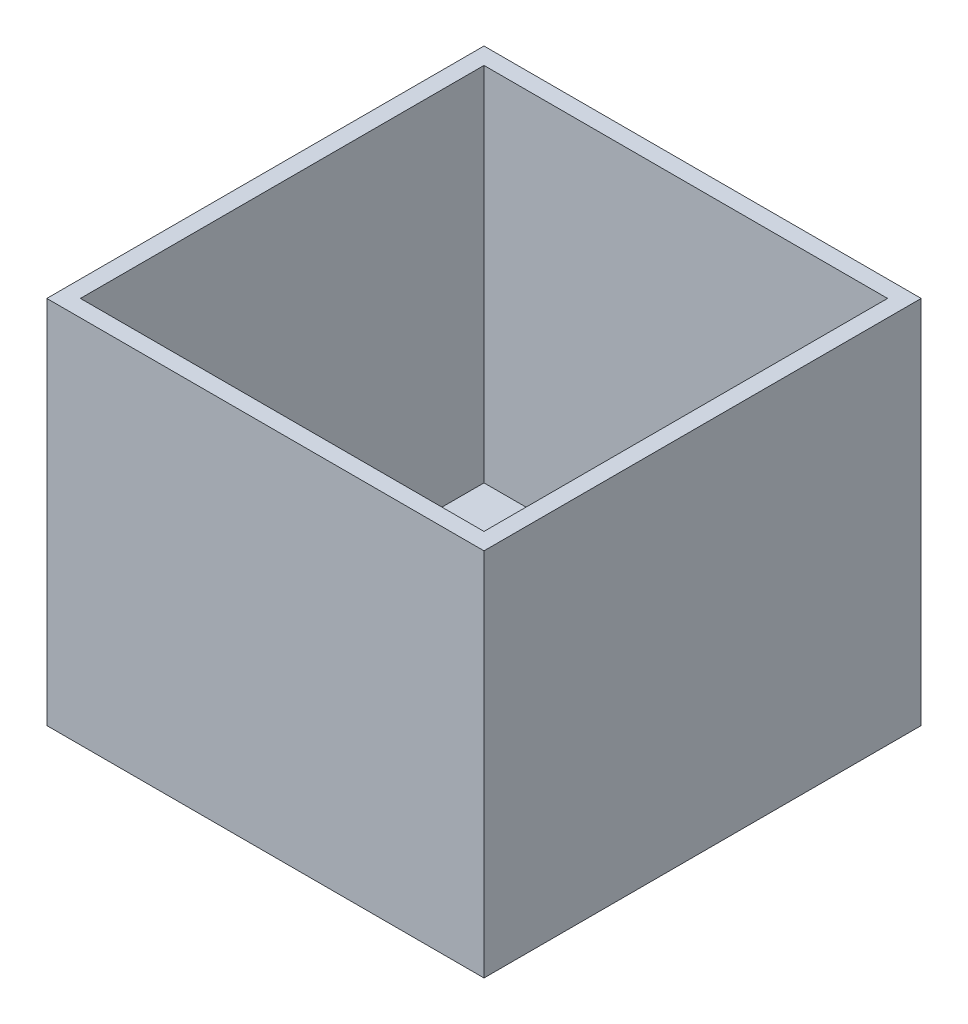
ISO-10303-21;
HEADER;
FILE_DESCRIPTION(('STEP AP214'),'2;1');
FILE_NAME('part.step','',(''),(''),'','','');
FILE_SCHEMA(('AUTOMOTIVE_DESIGN { 1 0 10303 214 1 1 1 1 }'));
ENDSEC;
DATA;
#1=APPLICATION_CONTEXT('core data for automotive mechanical design processes');
#2=APPLICATION_PROTOCOL_DEFINITION('international standard','automotive_design',2000,#1);
#3=PRODUCT_CONTEXT('',#1,'mechanical');
#4=PRODUCT('Part','Part','',(#3));
#5=PRODUCT_RELATED_PRODUCT_CATEGORY('part','',(#4));
#6=PRODUCT_DEFINITION_FORMATION('','',#4);
#7=PRODUCT_DEFINITION_CONTEXT('part definition',#1,'design');
#8=PRODUCT_DEFINITION('design','',#6,#7);
#9=PRODUCT_DEFINITION_SHAPE('','',#8);
#10=(LENGTH_UNIT() NAMED_UNIT(*) SI_UNIT(.MILLI.,.METRE.));
#11=(NAMED_UNIT(*) PLANE_ANGLE_UNIT() SI_UNIT($,.RADIAN.));
#12=(NAMED_UNIT(*) SI_UNIT($,.STERADIAN.) SOLID_ANGLE_UNIT());
#13=UNCERTAINTY_MEASURE_WITH_UNIT(LENGTH_MEASURE(1.E-05),#10,'distance_accuracy_value','');
#14=(GEOMETRIC_REPRESENTATION_CONTEXT(3) GLOBAL_UNCERTAINTY_ASSIGNED_CONTEXT((#13)) GLOBAL_UNIT_ASSIGNED_CONTEXT((#10,
#11,#12)) REPRESENTATION_CONTEXT('',''));
#15=CARTESIAN_POINT('',(0.,0.,0.));
#16=DIRECTION('',(0.,0.,1.));
#17=DIRECTION('',(1.,0.,0.));
#18=AXIS2_PLACEMENT_3D('',#15,#16,#17);
#19=CARTESIAN_POINT('',(165.1,279.4,165.1));
#20=DIRECTION('',(-1.,0.,0.));
#21=DIRECTION('',(0.,0.,1.));
#22=AXIS2_PLACEMENT_3D('',#19,#20,#21);
#23=PLANE('',#22);
#24=DIRECTION('',(0.,0.,-1.));
#25=VECTOR('',#24,1.);
#26=CARTESIAN_POINT('',(165.1,0.,165.1));
#27=LINE('',#26,#25);
#28=CARTESIAN_POINT('',(165.1,0.,165.1));
#29=VERTEX_POINT('',#28);
#30=CARTESIAN_POINT('',(165.1,0.,-165.1));
#31=VERTEX_POINT('',#30);
#32=EDGE_CURVE('E140',#29,#31,#27,.T.);
#33=ORIENTED_EDGE('',*,*,#32,.T.);
#34=DIRECTION('',(0.,-1.,0.));
#35=VECTOR('',#34,1.);
#36=CARTESIAN_POINT('',(165.1,279.4,-165.1));
#37=LINE('',#36,#35);
#38=CARTESIAN_POINT('',(165.1,279.4,-165.1));
#39=VERTEX_POINT('',#38);
#40=EDGE_CURVE('E11',#39,#31,#37,.T.);
#41=ORIENTED_EDGE('',*,*,#40,.F.);
#42=DIRECTION('',(0.,0.,-1.));
#43=VECTOR('',#42,1.);
#44=CARTESIAN_POINT('',(165.1,279.4,165.1));
#45=LINE('',#44,#43);
#46=CARTESIAN_POINT('',(165.1,279.4,165.1));
#47=VERTEX_POINT('',#46);
#48=EDGE_CURVE('E144',#47,#39,#45,.T.);
#49=ORIENTED_EDGE('',*,*,#48,.F.);
#50=DIRECTION('',(0.,-1.,0.));
#51=VECTOR('',#50,1.);
#52=CARTESIAN_POINT('',(165.1,279.4,165.1));
#53=LINE('',#52,#51);
#54=EDGE_CURVE('E150',#47,#29,#53,.T.);
#55=ORIENTED_EDGE('',*,*,#54,.T.);
#56=EDGE_LOOP('',(#33,#41,#49,#55));
#57=FACE_BOUND('',#56,.T.);
#58=ADVANCED_FACE('F32',(#57),#23,.F.);
#59=CARTESIAN_POINT('',(-165.1,279.4,-165.1));
#60=DIRECTION('',(0.,0.,1.));
#61=DIRECTION('',(1.,0.,0.));
#62=AXIS2_PLACEMENT_3D('',#59,#60,#61);
#63=PLANE('',#62);
#64=DIRECTION('',(-1.,0.,0.));
#65=VECTOR('',#64,1.);
#66=CARTESIAN_POINT('',(-165.1,0.,-165.1));
#67=LINE('',#66,#65);
#68=CARTESIAN_POINT('',(-165.1,0.,-165.1));
#69=VERTEX_POINT('',#68);
#70=EDGE_CURVE('E153',#31,#69,#67,.T.);
#71=ORIENTED_EDGE('',*,*,#70,.T.);
#72=DIRECTION('',(0.,-1.,0.));
#73=VECTOR('',#72,1.);
#74=CARTESIAN_POINT('',(-165.1,279.4,-165.1));
#75=LINE('',#74,#73);
#76=CARTESIAN_POINT('',(-165.1,279.4,-165.1));
#77=VERTEX_POINT('',#76);
#78=EDGE_CURVE('E39',#77,#69,#75,.T.);
#79=ORIENTED_EDGE('',*,*,#78,.F.);
#80=DIRECTION('',(-1.,0.,0.));
#81=VECTOR('',#80,1.);
#82=CARTESIAN_POINT('',(-165.1,279.4,-165.1));
#83=LINE('',#82,#81);
#84=EDGE_CURVE('E83',#39,#77,#83,.T.);
#85=ORIENTED_EDGE('',*,*,#84,.F.);
#86=ORIENTED_EDGE('',*,*,#40,.T.);
#87=EDGE_LOOP('',(#71,#79,#85,#86));
#88=FACE_BOUND('',#87,.T.);
#89=ADVANCED_FACE('F182',(#88),#63,.F.);
#90=CARTESIAN_POINT('',(-165.1,279.4,165.1));
#91=DIRECTION('',(1.,0.,0.));
#92=DIRECTION('',(0.,0.,-1.));
#93=AXIS2_PLACEMENT_3D('',#90,#91,#92);
#94=PLANE('',#93);
#95=DIRECTION('',(0.,0.,1.));
#96=VECTOR('',#95,1.);
#97=CARTESIAN_POINT('',(-165.1,0.,165.1));
#98=LINE('',#97,#96);
#99=CARTESIAN_POINT('',(-165.1,0.,165.1));
#100=VERTEX_POINT('',#99);
#101=EDGE_CURVE('E155',#69,#100,#98,.T.);
#102=ORIENTED_EDGE('',*,*,#101,.T.);
#103=DIRECTION('',(0.,-1.,0.));
#104=VECTOR('',#103,1.);
#105=CARTESIAN_POINT('',(-165.1,279.4,165.1));
#106=LINE('',#105,#104);
#107=CARTESIAN_POINT('',(-165.1,279.4,165.1));
#108=VERTEX_POINT('',#107);
#109=EDGE_CURVE('E159',#108,#100,#106,.T.);
#110=ORIENTED_EDGE('',*,*,#109,.F.);
#111=DIRECTION('',(0.,0.,1.));
#112=VECTOR('',#111,1.);
#113=CARTESIAN_POINT('',(-165.1,279.4,165.1));
#114=LINE('',#113,#112);
#115=EDGE_CURVE('E147',#77,#108,#114,.T.);
#116=ORIENTED_EDGE('',*,*,#115,.F.);
#117=ORIENTED_EDGE('',*,*,#78,.T.);
#118=EDGE_LOOP('',(#102,#110,#116,#117));
#119=FACE_BOUND('',#118,.T.);
#120=ADVANCED_FACE('F164',(#119),#94,.F.);
#121=CARTESIAN_POINT('',(-165.1,279.4,165.1));
#122=DIRECTION('',(0.,0.,-1.));
#123=DIRECTION('',(-1.,0.,0.));
#124=AXIS2_PLACEMENT_3D('',#121,#122,#123);
#125=PLANE('',#124);
#126=DIRECTION('',(1.,0.,0.));
#127=VECTOR('',#126,1.);
#128=CARTESIAN_POINT('',(-165.1,0.,165.1));
#129=LINE('',#128,#127);
#130=EDGE_CURVE('E76',#100,#29,#129,.T.);
#131=ORIENTED_EDGE('',*,*,#130,.T.);
#132=ORIENTED_EDGE('',*,*,#54,.F.);
#133=DIRECTION('',(1.,0.,0.));
#134=VECTOR('',#133,1.);
#135=CARTESIAN_POINT('',(-165.1,279.4,165.1));
#136=LINE('',#135,#134);
#137=EDGE_CURVE('E55',#108,#47,#136,.T.);
#138=ORIENTED_EDGE('',*,*,#137,.F.);
#139=ORIENTED_EDGE('',*,*,#109,.T.);
#140=EDGE_LOOP('',(#131,#132,#138,#139));
#141=FACE_BOUND('',#140,.T.);
#142=ADVANCED_FACE('F172',(#141),#125,.F.);
#143=CARTESIAN_POINT('',(0.,279.4,0.));
#144=DIRECTION('',(0.,-1.,0.));
#145=DIRECTION('',(0.,0.,-1.));
#146=AXIS2_PLACEMENT_3D('',#143,#144,#145);
#147=PLANE('',#146);
#148=DIRECTION('',(-1.,0.,0.));
#149=VECTOR('',#148,1.);
#150=CARTESIAN_POINT('',(-152.4,279.4,-152.4));
#151=LINE('',#150,#149);
#152=CARTESIAN_POINT('',(152.4,279.4,-152.4));
#153=VERTEX_POINT('',#152);
#154=CARTESIAN_POINT('',(-152.4,279.4,-152.4));
#155=VERTEX_POINT('',#154);
#156=EDGE_CURVE('E134',#153,#155,#151,.T.);
#157=ORIENTED_EDGE('',*,*,#156,.F.);
#158=DIRECTION('',(0.,0.,-1.));
#159=VECTOR('',#158,1.);
#160=CARTESIAN_POINT('',(152.4,279.4,152.4));
#161=LINE('',#160,#159);
#162=CARTESIAN_POINT('',(152.4,279.4,152.4));
#163=VERTEX_POINT('',#162);
#164=EDGE_CURVE('E46',#163,#153,#161,.T.);
#165=ORIENTED_EDGE('',*,*,#164,.F.);
#166=DIRECTION('',(1.,0.,0.));
#167=VECTOR('',#166,1.);
#168=CARTESIAN_POINT('',(-152.4,279.4,152.4));
#169=LINE('',#168,#167);
#170=CARTESIAN_POINT('',(-152.4,279.4,152.4));
#171=VERTEX_POINT('',#170);
#172=EDGE_CURVE('E125',#171,#163,#169,.T.);
#173=ORIENTED_EDGE('',*,*,#172,.F.);
#174=DIRECTION('',(0.,0.,1.));
#175=VECTOR('',#174,1.);
#176=CARTESIAN_POINT('',(-152.4,279.4,152.4));
#177=LINE('',#176,#175);
#178=EDGE_CURVE('E128',#155,#171,#177,.T.);
#179=ORIENTED_EDGE('',*,*,#178,.F.);
#180=EDGE_LOOP('',(#157,#165,#173,#179));
#181=FACE_BOUND('',#180,.T.);
#182=ORIENTED_EDGE('',*,*,#48,.T.);
#183=ORIENTED_EDGE('',*,*,#84,.T.);
#184=ORIENTED_EDGE('',*,*,#115,.T.);
#185=ORIENTED_EDGE('',*,*,#137,.T.);
#186=EDGE_LOOP('',(#182,#183,#184,#185));
#187=FACE_BOUND('',#186,.T.);
#188=ADVANCED_FACE('F174',(#181,#187),#147,.F.);
#189=CARTESIAN_POINT('',(0.,0.,0.));
#190=DIRECTION('',(0.,-1.,0.));
#191=DIRECTION('',(0.,0.,-1.));
#192=AXIS2_PLACEMENT_3D('',#189,#190,#191);
#193=PLANE('',#192);
#194=ORIENTED_EDGE('',*,*,#32,.F.);
#195=ORIENTED_EDGE('',*,*,#130,.F.);
#196=ORIENTED_EDGE('',*,*,#101,.F.);
#197=ORIENTED_EDGE('',*,*,#70,.F.);
#198=EDGE_LOOP('',(#194,#195,#196,#197));
#199=FACE_BOUND('',#198,.T.);
#200=ADVANCED_FACE('F168',(#199),#193,.T.);
#201=CARTESIAN_POINT('',(152.4,6.34999999999997,152.4));
#202=DIRECTION('',(1.,0.,0.));
#203=DIRECTION('',(0.,0.,-1.));
#204=AXIS2_PLACEMENT_3D('',#201,#202,#203);
#205=PLANE('',#204);
#206=ORIENTED_EDGE('',*,*,#164,.T.);
#207=DIRECTION('',(0.,1.,0.));
#208=VECTOR('',#207,1.);
#209=CARTESIAN_POINT('',(152.4,6.34999999999997,-152.4));
#210=LINE('',#209,#208);
#211=CARTESIAN_POINT('',(152.4,6.34999999999997,-152.4));
#212=VERTEX_POINT('',#211);
#213=EDGE_CURVE('E103',#212,#153,#210,.T.);
#214=ORIENTED_EDGE('',*,*,#213,.F.);
#215=DIRECTION('',(0.,0.,-1.));
#216=VECTOR('',#215,1.);
#217=CARTESIAN_POINT('',(152.4,6.34999999999997,152.4));
#218=LINE('',#217,#216);
#219=CARTESIAN_POINT('',(152.4,6.34999999999997,152.4));
#220=VERTEX_POINT('',#219);
#221=EDGE_CURVE('E107',#220,#212,#218,.T.);
#222=ORIENTED_EDGE('',*,*,#221,.F.);
#223=DIRECTION('',(0.,1.,0.));
#224=VECTOR('',#223,1.);
#225=CARTESIAN_POINT('',(152.4,6.34999999999997,152.4));
#226=LINE('',#225,#224);
#227=EDGE_CURVE('E138',#220,#163,#226,.T.);
#228=ORIENTED_EDGE('',*,*,#227,.T.);
#229=EDGE_LOOP('',(#206,#214,#222,#228));
#230=FACE_BOUND('',#229,.T.);
#231=ADVANCED_FACE('F105',(#230),#205,.F.);
#232=CARTESIAN_POINT('',(-152.4,6.34999999999997,152.4));
#233=DIRECTION('',(0.,0.,1.));
#234=DIRECTION('',(1.,0.,0.));
#235=AXIS2_PLACEMENT_3D('',#232,#233,#234);
#236=PLANE('',#235);
#237=ORIENTED_EDGE('',*,*,#172,.T.);
#238=ORIENTED_EDGE('',*,*,#227,.F.);
#239=DIRECTION('',(1.,0.,0.));
#240=VECTOR('',#239,1.);
#241=CARTESIAN_POINT('',(-152.4,6.34999999999997,152.4));
#242=LINE('',#241,#240);
#243=CARTESIAN_POINT('',(-152.4,6.34999999999997,152.4));
#244=VERTEX_POINT('',#243);
#245=EDGE_CURVE('E113',#244,#220,#242,.T.);
#246=ORIENTED_EDGE('',*,*,#245,.F.);
#247=DIRECTION('',(0.,1.,0.));
#248=VECTOR('',#247,1.);
#249=CARTESIAN_POINT('',(-152.4,6.34999999999997,152.4));
#250=LINE('',#249,#248);
#251=EDGE_CURVE('E141',#244,#171,#250,.T.);
#252=ORIENTED_EDGE('',*,*,#251,.T.);
#253=EDGE_LOOP('',(#237,#238,#246,#252));
#254=FACE_BOUND('',#253,.T.);
#255=ADVANCED_FACE('F221',(#254),#236,.F.);
#256=CARTESIAN_POINT('',(-152.4,6.34999999999997,152.4));
#257=DIRECTION('',(-1.,0.,0.));
#258=DIRECTION('',(0.,0.,1.));
#259=AXIS2_PLACEMENT_3D('',#256,#257,#258);
#260=PLANE('',#259);
#261=ORIENTED_EDGE('',*,*,#178,.T.);
#262=ORIENTED_EDGE('',*,*,#251,.F.);
#263=DIRECTION('',(0.,0.,1.));
#264=VECTOR('',#263,1.);
#265=CARTESIAN_POINT('',(-152.4,6.34999999999997,152.4));
#266=LINE('',#265,#264);
#267=CARTESIAN_POINT('',(-152.4,6.34999999999997,-152.4));
#268=VERTEX_POINT('',#267);
#269=EDGE_CURVE('E121',#268,#244,#266,.T.);
#270=ORIENTED_EDGE('',*,*,#269,.F.);
#271=DIRECTION('',(0.,1.,0.));
#272=VECTOR('',#271,1.);
#273=CARTESIAN_POINT('',(-152.4,6.34999999999997,-152.4));
#274=LINE('',#273,#272);
#275=EDGE_CURVE('E112',#268,#155,#274,.T.);
#276=ORIENTED_EDGE('',*,*,#275,.T.);
#277=EDGE_LOOP('',(#261,#262,#270,#276));
#278=FACE_BOUND('',#277,.T.);
#279=ADVANCED_FACE('F230',(#278),#260,.F.);
#280=CARTESIAN_POINT('',(-152.4,6.34999999999997,-152.4));
#281=DIRECTION('',(0.,0.,-1.));
#282=DIRECTION('',(-1.,0.,0.));
#283=AXIS2_PLACEMENT_3D('',#280,#281,#282);
#284=PLANE('',#283);
#285=ORIENTED_EDGE('',*,*,#156,.T.);
#286=ORIENTED_EDGE('',*,*,#275,.F.);
#287=DIRECTION('',(-1.,0.,0.));
#288=VECTOR('',#287,1.);
#289=CARTESIAN_POINT('',(-152.4,6.34999999999997,-152.4));
#290=LINE('',#289,#288);
#291=EDGE_CURVE('E116',#212,#268,#290,.T.);
#292=ORIENTED_EDGE('',*,*,#291,.F.);
#293=ORIENTED_EDGE('',*,*,#213,.T.);
#294=EDGE_LOOP('',(#285,#286,#292,#293));
#295=FACE_BOUND('',#294,.T.);
#296=ADVANCED_FACE('F117',(#295),#284,.F.);
#297=CARTESIAN_POINT('',(0.,6.34999999999997,0.));
#298=DIRECTION('',(0.,-1.,0.));
#299=DIRECTION('',(0.,0.,-1.));
#300=AXIS2_PLACEMENT_3D('',#297,#298,#299);
#301=PLANE('',#300);
#302=ORIENTED_EDGE('',*,*,#221,.T.);
#303=ORIENTED_EDGE('',*,*,#291,.T.);
#304=ORIENTED_EDGE('',*,*,#269,.T.);
#305=ORIENTED_EDGE('',*,*,#245,.T.);
#306=EDGE_LOOP('',(#302,#303,#304,#305));
#307=FACE_BOUND('',#306,.T.);
#308=ADVANCED_FACE('F123',(#307),#301,.F.);
#309=CLOSED_SHELL('',(#58,#89,#120,#142,#188,#200,#231,#255,#279,#296,#308));
#310=MANIFOLD_SOLID_BREP('B2',#309);
#311=ADVANCED_BREP_SHAPE_REPRESENTATION('',(#18,#310),#14);
#312=SHAPE_DEFINITION_REPRESENTATION(#9,#311);
ENDSEC;
END-ISO-10303-21;
